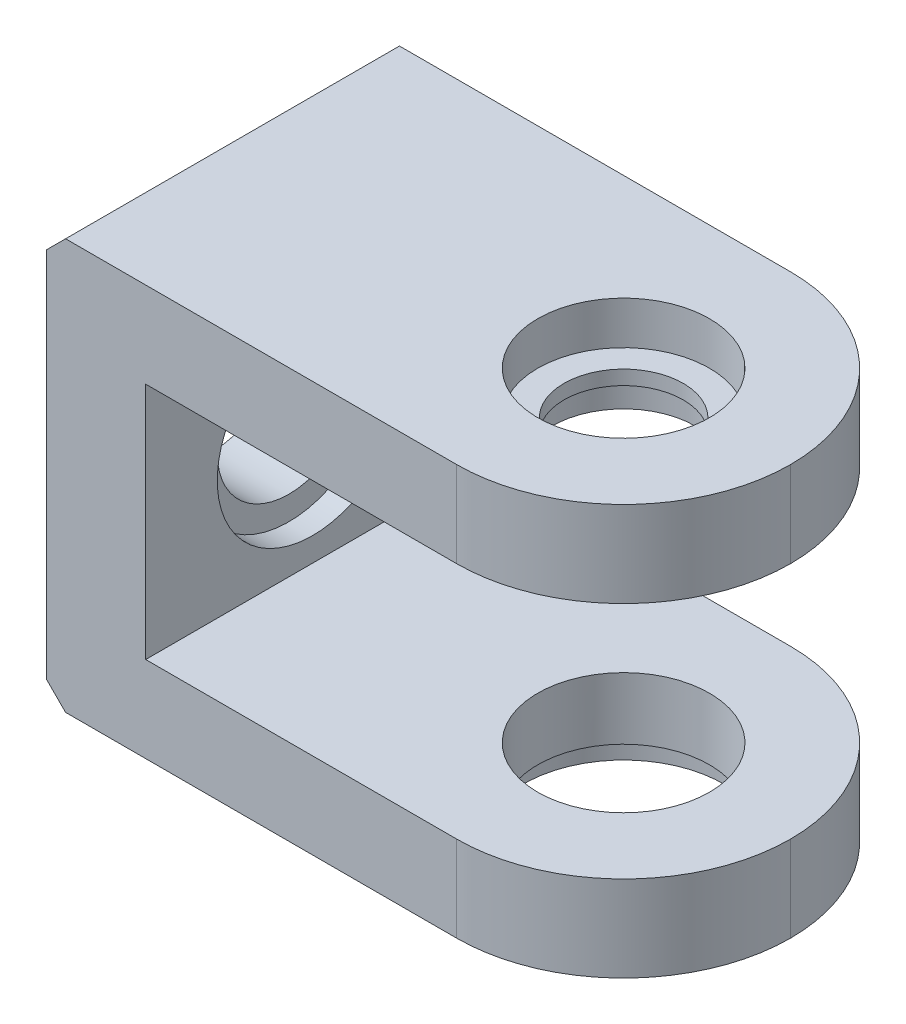
ISO-10303-21;
HEADER;
FILE_DESCRIPTION(('STEP AP214'),'2;1');
FILE_NAME('part.step','',(''),(''),'','','');
FILE_SCHEMA(('AUTOMOTIVE_DESIGN { 1 0 10303 214 1 1 1 1 }'));
ENDSEC;
DATA;
#1=APPLICATION_CONTEXT('core data for automotive mechanical design processes');
#2=APPLICATION_PROTOCOL_DEFINITION('international standard','automotive_design',2000,#1);
#3=PRODUCT_CONTEXT('',#1,'mechanical');
#4=PRODUCT('Part','Part','',(#3));
#5=PRODUCT_RELATED_PRODUCT_CATEGORY('part','',(#4));
#6=PRODUCT_DEFINITION_FORMATION('','',#4);
#7=PRODUCT_DEFINITION_CONTEXT('part definition',#1,'design');
#8=PRODUCT_DEFINITION('design','',#6,#7);
#9=PRODUCT_DEFINITION_SHAPE('','',#8);
#10=(LENGTH_UNIT() NAMED_UNIT(*) SI_UNIT(.MILLI.,.METRE.));
#11=(NAMED_UNIT(*) PLANE_ANGLE_UNIT() SI_UNIT($,.RADIAN.));
#12=(NAMED_UNIT(*) SI_UNIT($,.STERADIAN.) SOLID_ANGLE_UNIT());
#13=UNCERTAINTY_MEASURE_WITH_UNIT(LENGTH_MEASURE(1.E-05),#10,'distance_accuracy_value','');
#14=(GEOMETRIC_REPRESENTATION_CONTEXT(3) GLOBAL_UNCERTAINTY_ASSIGNED_CONTEXT((#13)) GLOBAL_UNIT_ASSIGNED_CONTEXT((#10,
#11,#12)) REPRESENTATION_CONTEXT('',''));
#15=CARTESIAN_POINT('',(0.,0.,0.));
#16=DIRECTION('',(0.,0.,1.));
#17=DIRECTION('',(1.,0.,0.));
#18=AXIS2_PLACEMENT_3D('',#15,#16,#17);
#19=CARTESIAN_POINT('',(-35.,0.001000000000001,35.));
#20=DIRECTION('',(0.,-1.,0.));
#21=DIRECTION('',(1.,0.,0.));
#22=AXIS2_PLACEMENT_3D('',#19,#20,#21);
#23=CYLINDRICAL_SURFACE('',#22,18.);
#24=CARTESIAN_POINT('',(-35.,-68.,35.));
#25=DIRECTION('',(0.,1.,0.));
#26=DIRECTION('',(0.,0.,1.));
#27=AXIS2_PLACEMENT_3D('',#24,#25,#26);
#28=CIRCLE('',#27,18.);
#29=CARTESIAN_POINT('',(-35.,-68.,53.));
#30=VERTEX_POINT('',#29);
#31=EDGE_CURVE('E206',#30,#30,#28,.F.);
#32=ORIENTED_EDGE('',*,*,#31,.F.);
#33=EDGE_LOOP('',(#32));
#34=FACE_BOUND('',#33,.T.);
#35=CARTESIAN_POINT('',(-35.,-81.,35.));
#36=DIRECTION('',(0.,-1.,0.));
#37=DIRECTION('',(1.,0.,0.));
#38=AXIS2_PLACEMENT_3D('',#35,#36,#37);
#39=CIRCLE('',#38,18.);
#40=CARTESIAN_POINT('',(-17.,-81.,35.));
#41=VERTEX_POINT('',#40);
#42=EDGE_CURVE('E203',#41,#41,#39,.F.);
#43=ORIENTED_EDGE('',*,*,#42,.F.);
#44=EDGE_LOOP('',(#43));
#45=FACE_BOUND('',#44,.T.);
#46=ADVANCED_FACE('F35',(#34,#45),#23,.F.);
#47=CARTESIAN_POINT('',(-35.,-86.001,35.));
#48=DIRECTION('',(0.,1.,0.));
#49=DIRECTION('',(-1.,0.,0.));
#50=AXIS2_PLACEMENT_3D('',#47,#48,#49);
#51=CYLINDRICAL_SURFACE('',#50,12.5);
#52=CARTESIAN_POINT('',(-35.,-9.00000000000001,35.));
#53=DIRECTION('',(0.,1.,0.));
#54=DIRECTION('',(-1.,0.,0.));
#55=AXIS2_PLACEMENT_3D('',#52,#53,#54);
#56=CIRCLE('',#55,12.5);
#57=CARTESIAN_POINT('',(-47.5,-9.00000000000001,35.));
#58=VERTEX_POINT('',#57);
#59=EDGE_CURVE('E193',#58,#58,#56,.F.);
#60=ORIENTED_EDGE('',*,*,#59,.F.);
#61=EDGE_LOOP('',(#60));
#62=FACE_BOUND('',#61,.T.);
#63=CARTESIAN_POINT('',(-35.,-12.,35.));
#64=DIRECTION('',(0.,-1.,0.));
#65=DIRECTION('',(0.,0.,-1.));
#66=AXIS2_PLACEMENT_3D('',#63,#64,#65);
#67=CIRCLE('',#66,12.5);
#68=CARTESIAN_POINT('',(-35.,-12.,22.5));
#69=VERTEX_POINT('',#68);
#70=EDGE_CURVE('E198',#69,#69,#67,.F.);
#71=ORIENTED_EDGE('',*,*,#70,.F.);
#72=EDGE_LOOP('',(#71));
#73=FACE_BOUND('',#72,.T.);
#74=ADVANCED_FACE('F317',(#62,#73),#51,.F.);
#75=CARTESIAN_POINT('',(0.001000000000001,-43.,35.));
#76=DIRECTION('',(-1.,0.,0.));
#77=DIRECTION('',(0.,0.,1.));
#78=AXIS2_PLACEMENT_3D('',#75,#76,#77);
#79=CYLINDRICAL_SURFACE('',#78,15.);
#80=CARTESIAN_POINT('',(-121.,-43.,35.));
#81=DIRECTION('',(-1.,0.,0.));
#82=DIRECTION('',(0.,0.,1.));
#83=AXIS2_PLACEMENT_3D('',#80,#81,#82);
#84=CIRCLE('',#83,15.);
#85=CARTESIAN_POINT('',(-121.,-43.,50.));
#86=VERTEX_POINT('',#85);
#87=EDGE_CURVE('E188',#86,#86,#84,.T.);
#88=ORIENTED_EDGE('',*,*,#87,.T.);
#89=EDGE_LOOP('',(#88));
#90=FACE_BOUND('',#89,.T.);
#91=CARTESIAN_POINT('',(-105.200761753188,-43.,35.));
#92=DIRECTION('',(1.,0.,0.));
#93=DIRECTION('',(0.,0.,-1.));
#94=AXIS2_PLACEMENT_3D('',#91,#92,#93);
#95=CIRCLE('',#94,15.);
#96=CARTESIAN_POINT('',(-105.200761753188,-43.,20.));
#97=VERTEX_POINT('',#96);
#98=EDGE_CURVE('E189',#97,#97,#95,.F.);
#99=ORIENTED_EDGE('',*,*,#98,.F.);
#100=EDGE_LOOP('',(#99));
#101=FACE_BOUND('',#100,.T.);
#102=ADVANCED_FACE('F323',(#90,#101),#79,.F.);
#103=CARTESIAN_POINT('',(-100.200761753188,-68.,70.));
#104=DIRECTION('',(-1.,0.,0.));
#105=DIRECTION('',(0.,0.,1.));
#106=AXIS2_PLACEMENT_3D('',#103,#104,#105);
#107=PLANE('',#106);
#108=CARTESIAN_POINT('',(-100.200761753188,-43.,35.));
#109=DIRECTION('',(1.,0.,0.));
#110=DIRECTION('',(0.,0.,-1.));
#111=AXIS2_PLACEMENT_3D('',#108,#109,#110);
#112=CIRCLE('',#111,20.);
#113=CARTESIAN_POINT('',(-100.200761753188,-43.,15.));
#114=VERTEX_POINT('',#113);
#115=EDGE_CURVE('E196',#114,#114,#112,.T.);
#116=ORIENTED_EDGE('',*,*,#115,.F.);
#117=EDGE_LOOP('',(#116));
#118=FACE_BOUND('',#117,.T.);
#119=DIRECTION('',(0.,1.,0.));
#120=VECTOR('',#119,1.);
#121=CARTESIAN_POINT('',(-100.200761753188,-68.,0.));
#122=LINE('',#121,#120);
#123=CARTESIAN_POINT('',(-100.200761753188,-68.,0.));
#124=VERTEX_POINT('',#123);
#125=CARTESIAN_POINT('',(-100.200761753188,-18.,0.));
#126=VERTEX_POINT('',#125);
#127=EDGE_CURVE('E152',#124,#126,#122,.T.);
#128=ORIENTED_EDGE('',*,*,#127,.T.);
#129=DIRECTION('',(0.,0.,-1.));
#130=VECTOR('',#129,1.);
#131=CARTESIAN_POINT('',(-100.200761753188,-18.,70.));
#132=LINE('',#131,#130);
#133=CARTESIAN_POINT('',(-100.200761753188,-18.,70.));
#134=VERTEX_POINT('',#133);
#135=EDGE_CURVE('E131',#134,#126,#132,.T.);
#136=ORIENTED_EDGE('',*,*,#135,.F.);
#137=DIRECTION('',(0.,1.,0.));
#138=VECTOR('',#137,1.);
#139=CARTESIAN_POINT('',(-100.200761753188,-68.,70.));
#140=LINE('',#139,#138);
#141=CARTESIAN_POINT('',(-100.200761753188,-68.,70.));
#142=VERTEX_POINT('',#141);
#143=EDGE_CURVE('E139',#142,#134,#140,.T.);
#144=ORIENTED_EDGE('',*,*,#143,.F.);
#145=DIRECTION('',(0.,0.,-1.));
#146=VECTOR('',#145,1.);
#147=CARTESIAN_POINT('',(-100.200761753188,-68.,70.));
#148=LINE('',#147,#146);
#149=EDGE_CURVE('E154',#142,#124,#148,.T.);
#150=ORIENTED_EDGE('',*,*,#149,.T.);
#151=EDGE_LOOP('',(#128,#136,#144,#150));
#152=FACE_BOUND('',#151,.T.);
#153=ADVANCED_FACE('F150',(#118,#152),#107,.F.);
#154=CARTESIAN_POINT('',(-100.200761753188,-18.,70.));
#155=DIRECTION('',(0.,1.,0.));
#156=DIRECTION('',(0.,0.,1.));
#157=AXIS2_PLACEMENT_3D('',#154,#155,#156);
#158=PLANE('',#157);
#159=CARTESIAN_POINT('',(-35.,-18.,35.));
#160=DIRECTION('',(0.,-1.,0.));
#161=DIRECTION('',(0.,0.,-1.));
#162=AXIS2_PLACEMENT_3D('',#159,#160,#161);
#163=CIRCLE('',#162,15.);
#164=CARTESIAN_POINT('',(-35.,-18.,20.));
#165=VERTEX_POINT('',#164);
#166=EDGE_CURVE('E284',#165,#165,#163,.T.);
#167=ORIENTED_EDGE('',*,*,#166,.F.);
#168=EDGE_LOOP('',(#167));
#169=FACE_BOUND('',#168,.T.);
#170=CARTESIAN_POINT('',(-35.,-18.,35.));
#171=DIRECTION('',(0.,1.,0.));
#172=DIRECTION('',(0.,0.,1.));
#173=AXIS2_PLACEMENT_3D('',#170,#171,#172);
#174=CIRCLE('',#173,35.);
#175=CARTESIAN_POINT('',(-35.,-18.,0.));
#176=VERTEX_POINT('',#175);
#177=CARTESIAN_POINT('',(0.,-18.,35.));
#178=VERTEX_POINT('',#177);
#179=EDGE_CURVE('E178',#176,#178,#174,.F.);
#180=ORIENTED_EDGE('',*,*,#179,.T.);
#181=CARTESIAN_POINT('',(-35.,-18.,35.));
#182=DIRECTION('',(0.,1.,0.));
#183=DIRECTION('',(0.,0.,1.));
#184=AXIS2_PLACEMENT_3D('',#181,#182,#183);
#185=CIRCLE('',#184,35.);
#186=CARTESIAN_POINT('',(-35.,-18.,70.));
#187=VERTEX_POINT('',#186);
#188=EDGE_CURVE('E134',#178,#187,#185,.F.);
#189=ORIENTED_EDGE('',*,*,#188,.T.);
#190=DIRECTION('',(1.,0.,0.));
#191=VECTOR('',#190,1.);
#192=CARTESIAN_POINT('',(-100.200761753188,-18.,70.));
#193=LINE('',#192,#191);
#194=EDGE_CURVE('E126',#134,#187,#193,.T.);
#195=ORIENTED_EDGE('',*,*,#194,.F.);
#196=ORIENTED_EDGE('',*,*,#135,.T.);
#197=DIRECTION('',(1.,0.,0.));
#198=VECTOR('',#197,1.);
#199=CARTESIAN_POINT('',(-100.200761753188,-18.,0.));
#200=LINE('',#199,#198);
#201=EDGE_CURVE('E244',#126,#176,#200,.T.);
#202=ORIENTED_EDGE('',*,*,#201,.T.);
#203=EDGE_LOOP('',(#180,#189,#195,#196,#202));
#204=FACE_BOUND('',#203,.T.);
#205=ADVANCED_FACE('F128',(#169,#204),#158,.F.);
#206=CARTESIAN_POINT('',(0.,0.,70.));
#207=DIRECTION('',(0.,-1.,0.));
#208=DIRECTION('',(1.,0.,0.));
#209=AXIS2_PLACEMENT_3D('',#206,#207,#208);
#210=PLANE('',#209);
#211=CARTESIAN_POINT('',(-35.,0.,35.));
#212=DIRECTION('',(0.,1.,0.));
#213=DIRECTION('',(-1.,0.,0.));
#214=AXIS2_PLACEMENT_3D('',#211,#212,#213);
#215=CIRCLE('',#214,18.);
#216=CARTESIAN_POINT('',(-53.,0.,35.));
#217=VERTEX_POINT('',#216);
#218=EDGE_CURVE('E201',#217,#217,#215,.T.);
#219=ORIENTED_EDGE('',*,*,#218,.F.);
#220=EDGE_LOOP('',(#219));
#221=FACE_BOUND('',#220,.T.);
#222=DIRECTION('',(-1.,0.,0.));
#223=VECTOR('',#222,1.);
#224=CARTESIAN_POINT('',(0.,0.,0.));
#225=LINE('',#224,#223);
#226=CARTESIAN_POINT('',(-35.,0.,0.));
#227=VERTEX_POINT('',#226);
#228=CARTESIAN_POINT('',(-117.,0.,0.));
#229=VERTEX_POINT('',#228);
#230=EDGE_CURVE('E241',#227,#229,#225,.T.);
#231=ORIENTED_EDGE('',*,*,#230,.T.);
#232=DIRECTION('',(0.,0.,1.));
#233=VECTOR('',#232,1.);
#234=CARTESIAN_POINT('',(-117.,0.,70.));
#235=LINE('',#234,#233);
#236=CARTESIAN_POINT('',(-117.,0.,70.));
#237=VERTEX_POINT('',#236);
#238=EDGE_CURVE('E11',#229,#237,#235,.T.);
#239=ORIENTED_EDGE('',*,*,#238,.T.);
#240=DIRECTION('',(-1.,0.,0.));
#241=VECTOR('',#240,1.);
#242=CARTESIAN_POINT('',(0.,0.,70.));
#243=LINE('',#242,#241);
#244=CARTESIAN_POINT('',(-35.,0.,70.));
#245=VERTEX_POINT('',#244);
#246=EDGE_CURVE('E138',#245,#237,#243,.T.);
#247=ORIENTED_EDGE('',*,*,#246,.F.);
#248=CARTESIAN_POINT('',(-35.,0.,35.));
#249=DIRECTION('',(0.,-1.,0.));
#250=DIRECTION('',(1.,0.,0.));
#251=AXIS2_PLACEMENT_3D('',#248,#249,#250);
#252=CIRCLE('',#251,35.);
#253=CARTESIAN_POINT('',(0.,0.,35.));
#254=VERTEX_POINT('',#253);
#255=EDGE_CURVE('E176',#245,#254,#252,.F.);
#256=ORIENTED_EDGE('',*,*,#255,.T.);
#257=CARTESIAN_POINT('',(-35.,0.,35.));
#258=DIRECTION('',(0.,-1.,0.));
#259=DIRECTION('',(1.,0.,0.));
#260=AXIS2_PLACEMENT_3D('',#257,#258,#259);
#261=CIRCLE('',#260,35.);
#262=EDGE_CURVE('E174',#254,#227,#261,.F.);
#263=ORIENTED_EDGE('',*,*,#262,.T.);
#264=EDGE_LOOP('',(#231,#239,#247,#256,#263));
#265=FACE_BOUND('',#264,.T.);
#266=ADVANCED_FACE('F271',(#221,#265),#210,.F.);
#267=CARTESIAN_POINT('',(-121.,0.,70.));
#268=DIRECTION('',(1.,0.,0.));
#269=DIRECTION('',(0.,0.,-1.));
#270=AXIS2_PLACEMENT_3D('',#267,#268,#269);
#271=PLANE('',#270);
#272=ORIENTED_EDGE('',*,*,#87,.F.);
#273=EDGE_LOOP('',(#272));
#274=FACE_BOUND('',#273,.T.);
#275=DIRECTION('',(0.,-1.,0.));
#276=VECTOR('',#275,1.);
#277=CARTESIAN_POINT('',(-121.,0.,0.));
#278=LINE('',#277,#276);
#279=CARTESIAN_POINT('',(-121.,-4.,0.));
#280=VERTEX_POINT('',#279);
#281=CARTESIAN_POINT('',(-121.,-81.9999999999999,0.));
#282=VERTEX_POINT('',#281);
#283=EDGE_CURVE('E237',#280,#282,#278,.T.);
#284=ORIENTED_EDGE('',*,*,#283,.T.);
#285=DIRECTION('',(0.,0.,1.));
#286=VECTOR('',#285,1.);
#287=CARTESIAN_POINT('',(-121.,-81.9999999999999,70.));
#288=LINE('',#287,#286);
#289=CARTESIAN_POINT('',(-121.,-81.9999999999999,70.));
#290=VERTEX_POINT('',#289);
#291=EDGE_CURVE('E56',#282,#290,#288,.T.);
#292=ORIENTED_EDGE('',*,*,#291,.T.);
#293=DIRECTION('',(0.,-1.,0.));
#294=VECTOR('',#293,1.);
#295=CARTESIAN_POINT('',(-121.,0.,70.));
#296=LINE('',#295,#294);
#297=CARTESIAN_POINT('',(-121.,-4.,70.));
#298=VERTEX_POINT('',#297);
#299=EDGE_CURVE('E224',#298,#290,#296,.T.);
#300=ORIENTED_EDGE('',*,*,#299,.F.);
#301=DIRECTION('',(0.,0.,-1.));
#302=VECTOR('',#301,1.);
#303=CARTESIAN_POINT('',(-121.,-4.,70.));
#304=LINE('',#303,#302);
#305=EDGE_CURVE('E214',#298,#280,#304,.T.);
#306=ORIENTED_EDGE('',*,*,#305,.T.);
#307=EDGE_LOOP('',(#284,#292,#300,#306));
#308=FACE_BOUND('',#307,.T.);
#309=ADVANCED_FACE('F239',(#274,#308),#271,.F.);
#310=CARTESIAN_POINT('',(0.,-86.,70.));
#311=DIRECTION('',(0.,-1.,0.));
#312=DIRECTION('',(1.,0.,0.));
#313=AXIS2_PLACEMENT_3D('',#310,#311,#312);
#314=PLANE('',#313);
#315=CARTESIAN_POINT('',(-35.,-86.,35.));
#316=DIRECTION('',(0.,-1.,0.));
#317=DIRECTION('',(1.,0.,0.));
#318=AXIS2_PLACEMENT_3D('',#315,#316,#317);
#319=CIRCLE('',#318,21.);
#320=CARTESIAN_POINT('',(-14.,-86.,35.));
#321=VERTEX_POINT('',#320);
#322=EDGE_CURVE('E291',#321,#321,#319,.T.);
#323=ORIENTED_EDGE('',*,*,#322,.F.);
#324=EDGE_LOOP('',(#323));
#325=FACE_BOUND('',#324,.T.);
#326=DIRECTION('',(-1.,0.,0.));
#327=VECTOR('',#326,1.);
#328=CARTESIAN_POINT('',(0.,-86.,70.));
#329=LINE('',#328,#327);
#330=CARTESIAN_POINT('',(-35.,-86.,70.));
#331=VERTEX_POINT('',#330);
#332=CARTESIAN_POINT('',(-117.,-86.,70.));
#333=VERTEX_POINT('',#332);
#334=EDGE_CURVE('E222',#331,#333,#329,.T.);
#335=ORIENTED_EDGE('',*,*,#334,.T.);
#336=DIRECTION('',(0.,0.,-1.));
#337=VECTOR('',#336,1.);
#338=CARTESIAN_POINT('',(-117.,-86.,0.));
#339=LINE('',#338,#337);
#340=CARTESIAN_POINT('',(-117.,-86.,0.));
#341=VERTEX_POINT('',#340);
#342=EDGE_CURVE('E181',#333,#341,#339,.T.);
#343=ORIENTED_EDGE('',*,*,#342,.T.);
#344=DIRECTION('',(-1.,0.,0.));
#345=VECTOR('',#344,1.);
#346=CARTESIAN_POINT('',(0.,-86.,0.));
#347=LINE('',#346,#345);
#348=CARTESIAN_POINT('',(-35.,-86.,0.));
#349=VERTEX_POINT('',#348);
#350=EDGE_CURVE('E238',#349,#341,#347,.T.);
#351=ORIENTED_EDGE('',*,*,#350,.F.);
#352=CARTESIAN_POINT('',(-35.,-86.,35.));
#353=DIRECTION('',(0.,-1.,0.));
#354=DIRECTION('',(1.,0.,0.));
#355=AXIS2_PLACEMENT_3D('',#352,#353,#354);
#356=CIRCLE('',#355,35.);
#357=CARTESIAN_POINT('',(0.,-86.,35.));
#358=VERTEX_POINT('',#357);
#359=EDGE_CURVE('E153',#349,#358,#356,.T.);
#360=ORIENTED_EDGE('',*,*,#359,.T.);
#361=CARTESIAN_POINT('',(-35.,-86.,35.));
#362=DIRECTION('',(0.,-1.,0.));
#363=DIRECTION('',(1.,0.,0.));
#364=AXIS2_PLACEMENT_3D('',#361,#362,#363);
#365=CIRCLE('',#364,35.);
#366=EDGE_CURVE('E156',#358,#331,#365,.T.);
#367=ORIENTED_EDGE('',*,*,#366,.T.);
#368=EDGE_LOOP('',(#335,#343,#351,#360,#367));
#369=FACE_BOUND('',#368,.T.);
#370=ADVANCED_FACE('F228',(#325,#369),#314,.T.);
#371=CARTESIAN_POINT('',(-100.200761753188,-68.,70.));
#372=DIRECTION('',(0.,1.,0.));
#373=DIRECTION('',(0.,0.,1.));
#374=AXIS2_PLACEMENT_3D('',#371,#372,#373);
#375=PLANE('',#374);
#376=ORIENTED_EDGE('',*,*,#31,.T.);
#377=EDGE_LOOP('',(#376));
#378=FACE_BOUND('',#377,.T.);
#379=DIRECTION('',(1.,0.,0.));
#380=VECTOR('',#379,1.);
#381=CARTESIAN_POINT('',(-100.200761753188,-68.,70.));
#382=LINE('',#381,#380);
#383=CARTESIAN_POINT('',(-35.,-68.,70.));
#384=VERTEX_POINT('',#383);
#385=EDGE_CURVE('E146',#142,#384,#382,.T.);
#386=ORIENTED_EDGE('',*,*,#385,.T.);
#387=CARTESIAN_POINT('',(-35.,-68.,35.));
#388=DIRECTION('',(0.,1.,0.));
#389=DIRECTION('',(0.,0.,1.));
#390=AXIS2_PLACEMENT_3D('',#387,#388,#389);
#391=CIRCLE('',#390,35.);
#392=CARTESIAN_POINT('',(0.,-68.,35.));
#393=VERTEX_POINT('',#392);
#394=EDGE_CURVE('E168',#384,#393,#391,.T.);
#395=ORIENTED_EDGE('',*,*,#394,.T.);
#396=CARTESIAN_POINT('',(-35.,-68.,35.));
#397=DIRECTION('',(0.,1.,0.));
#398=DIRECTION('',(0.,0.,1.));
#399=AXIS2_PLACEMENT_3D('',#396,#397,#398);
#400=CIRCLE('',#399,35.);
#401=CARTESIAN_POINT('',(-35.,-68.,0.));
#402=VERTEX_POINT('',#401);
#403=EDGE_CURVE('E166',#393,#402,#400,.T.);
#404=ORIENTED_EDGE('',*,*,#403,.T.);
#405=DIRECTION('',(1.,0.,0.));
#406=VECTOR('',#405,1.);
#407=CARTESIAN_POINT('',(-100.200761753188,-68.,0.));
#408=LINE('',#407,#406);
#409=EDGE_CURVE('E148',#124,#402,#408,.T.);
#410=ORIENTED_EDGE('',*,*,#409,.F.);
#411=ORIENTED_EDGE('',*,*,#149,.F.);
#412=EDGE_LOOP('',(#386,#395,#404,#410,#411));
#413=FACE_BOUND('',#412,.T.);
#414=ADVANCED_FACE('F258',(#378,#413),#375,.T.);
#415=CARTESIAN_POINT('',(0.,0.,70.));
#416=DIRECTION('',(0.,0.,-1.));
#417=DIRECTION('',(-1.,0.,0.));
#418=AXIS2_PLACEMENT_3D('',#415,#416,#417);
#419=PLANE('',#418);
#420=ORIENTED_EDGE('',*,*,#299,.T.);
#421=DIRECTION('',(0.707106781186546,-0.707106781186549,0.));
#422=VECTOR('',#421,1.);
#423=CARTESIAN_POINT('',(-117.,-86.,70.));
#424=LINE('',#423,#422);
#425=EDGE_CURVE('E43',#290,#333,#424,.T.);
#426=ORIENTED_EDGE('',*,*,#425,.T.);
#427=ORIENTED_EDGE('',*,*,#334,.F.);
#428=DIRECTION('',(0.,-1.,0.));
#429=VECTOR('',#428,1.);
#430=CARTESIAN_POINT('',(-35.,-68.,70.));
#431=LINE('',#430,#429);
#432=EDGE_CURVE('E164',#331,#384,#431,.F.);
#433=ORIENTED_EDGE('',*,*,#432,.T.);
#434=ORIENTED_EDGE('',*,*,#385,.F.);
#435=ORIENTED_EDGE('',*,*,#143,.T.);
#436=ORIENTED_EDGE('',*,*,#194,.T.);
#437=DIRECTION('',(0.,1.,0.));
#438=VECTOR('',#437,1.);
#439=CARTESIAN_POINT('',(-35.,0.,70.));
#440=LINE('',#439,#438);
#441=EDGE_CURVE('E162',#187,#245,#440,.T.);
#442=ORIENTED_EDGE('',*,*,#441,.T.);
#443=ORIENTED_EDGE('',*,*,#246,.T.);
#444=DIRECTION('',(0.70710678118655,0.707106781186545,0.));
#445=VECTOR('',#444,1.);
#446=CARTESIAN_POINT('',(-121.,-4.,70.));
#447=LINE('',#446,#445);
#448=EDGE_CURVE('E218',#237,#298,#447,.F.);
#449=ORIENTED_EDGE('',*,*,#448,.T.);
#450=EDGE_LOOP('',(#420,#426,#427,#433,#434,#435,#436,#442,#443,#449));
#451=FACE_BOUND('',#450,.T.);
#452=ADVANCED_FACE('F143',(#451),#419,.F.);
#453=CARTESIAN_POINT('',(0.,0.,0.));
#454=DIRECTION('',(0.,0.,-1.));
#455=DIRECTION('',(-1.,0.,0.));
#456=AXIS2_PLACEMENT_3D('',#453,#454,#455);
#457=PLANE('',#456);
#458=ORIENTED_EDGE('',*,*,#350,.T.);
#459=DIRECTION('',(-0.707106781186546,0.707106781186549,0.));
#460=VECTOR('',#459,1.);
#461=CARTESIAN_POINT('',(-101.5,-101.5,0.));
#462=LINE('',#461,#460);
#463=EDGE_CURVE('E212',#341,#282,#462,.T.);
#464=ORIENTED_EDGE('',*,*,#463,.T.);
#465=ORIENTED_EDGE('',*,*,#283,.F.);
#466=DIRECTION('',(-0.70710678118655,-0.707106781186545,0.));
#467=VECTOR('',#466,1.);
#468=CARTESIAN_POINT('',(-58.4999999999996,58.5,0.));
#469=LINE('',#468,#467);
#470=EDGE_CURVE('E210',#280,#229,#469,.F.);
#471=ORIENTED_EDGE('',*,*,#470,.T.);
#472=ORIENTED_EDGE('',*,*,#230,.F.);
#473=DIRECTION('',(0.,1.,0.));
#474=VECTOR('',#473,1.);
#475=CARTESIAN_POINT('',(-35.,-18.,0.));
#476=LINE('',#475,#474);
#477=EDGE_CURVE('E170',#227,#176,#476,.F.);
#478=ORIENTED_EDGE('',*,*,#477,.T.);
#479=ORIENTED_EDGE('',*,*,#201,.F.);
#480=ORIENTED_EDGE('',*,*,#127,.F.);
#481=ORIENTED_EDGE('',*,*,#409,.T.);
#482=DIRECTION('',(0.,-1.,0.));
#483=VECTOR('',#482,1.);
#484=CARTESIAN_POINT('',(-35.,0.,0.));
#485=LINE('',#484,#483);
#486=EDGE_CURVE('E172',#402,#349,#485,.T.);
#487=ORIENTED_EDGE('',*,*,#486,.T.);
#488=EDGE_LOOP('',(#458,#464,#465,#471,#472,#478,#479,#480,#481,#487));
#489=FACE_BOUND('',#488,.T.);
#490=ADVANCED_FACE('F236',(#489),#457,.T.);
#491=CARTESIAN_POINT('',(-35.,0.,35.));
#492=DIRECTION('',(0.,-1.,0.));
#493=DIRECTION('',(0.,0.,-1.));
#494=AXIS2_PLACEMENT_3D('',#491,#492,#493);
#495=CYLINDRICAL_SURFACE('',#494,35.);
#496=ORIENTED_EDGE('',*,*,#486,.F.);
#497=ORIENTED_EDGE('',*,*,#403,.F.);
#498=DIRECTION('',(0.,-1.,0.));
#499=VECTOR('',#498,1.);
#500=CARTESIAN_POINT('',(0.,-68.,35.));
#501=LINE('',#500,#499);
#502=EDGE_CURVE('E182',#358,#393,#501,.F.);
#503=ORIENTED_EDGE('',*,*,#502,.F.);
#504=ORIENTED_EDGE('',*,*,#359,.F.);
#505=EDGE_LOOP('',(#496,#497,#503,#504));
#506=FACE_BOUND('',#505,.T.);
#507=ADVANCED_FACE('F254',(#506),#495,.T.);
#508=CARTESIAN_POINT('',(-35.,-68.,35.));
#509=DIRECTION('',(0.,1.,0.));
#510=DIRECTION('',(0.,0.,1.));
#511=AXIS2_PLACEMENT_3D('',#508,#509,#510);
#512=CYLINDRICAL_SURFACE('',#511,35.);
#513=ORIENTED_EDGE('',*,*,#394,.F.);
#514=ORIENTED_EDGE('',*,*,#432,.F.);
#515=ORIENTED_EDGE('',*,*,#366,.F.);
#516=ORIENTED_EDGE('',*,*,#502,.T.);
#517=EDGE_LOOP('',(#513,#514,#515,#516));
#518=FACE_BOUND('',#517,.T.);
#519=ADVANCED_FACE('F257',(#518),#512,.T.);
#520=CARTESIAN_POINT('',(-35.,-18.,35.));
#521=DIRECTION('',(0.,-1.,0.));
#522=DIRECTION('',(0.,0.,-1.));
#523=AXIS2_PLACEMENT_3D('',#520,#521,#522);
#524=CYLINDRICAL_SURFACE('',#523,35.);
#525=DIRECTION('',(0.,1.,0.));
#526=VECTOR('',#525,1.);
#527=CARTESIAN_POINT('',(0.,0.,35.));
#528=LINE('',#527,#526);
#529=EDGE_CURVE('E185',#178,#254,#528,.T.);
#530=ORIENTED_EDGE('',*,*,#529,.F.);
#531=ORIENTED_EDGE('',*,*,#179,.F.);
#532=ORIENTED_EDGE('',*,*,#477,.F.);
#533=ORIENTED_EDGE('',*,*,#262,.F.);
#534=EDGE_LOOP('',(#530,#531,#532,#533));
#535=FACE_BOUND('',#534,.T.);
#536=ADVANCED_FACE('F266',(#535),#524,.T.);
#537=CARTESIAN_POINT('',(-35.,0.,35.));
#538=DIRECTION('',(0.,1.,0.));
#539=DIRECTION('',(0.,0.,1.));
#540=AXIS2_PLACEMENT_3D('',#537,#538,#539);
#541=CYLINDRICAL_SURFACE('',#540,35.);
#542=ORIENTED_EDGE('',*,*,#188,.F.);
#543=ORIENTED_EDGE('',*,*,#529,.T.);
#544=ORIENTED_EDGE('',*,*,#255,.F.);
#545=ORIENTED_EDGE('',*,*,#441,.F.);
#546=EDGE_LOOP('',(#542,#543,#544,#545));
#547=FACE_BOUND('',#546,.T.);
#548=ADVANCED_FACE('F269',(#547),#541,.T.);
#549=CARTESIAN_POINT('',(-105.200761753188,-43.,35.));
#550=DIRECTION('',(1.,0.,0.));
#551=DIRECTION('',(0.,0.,-1.));
#552=AXIS2_PLACEMENT_3D('',#549,#550,#551);
#553=PLANE('',#552);
#554=CARTESIAN_POINT('',(-105.200761753188,-43.,35.));
#555=DIRECTION('',(1.,0.,0.));
#556=DIRECTION('',(0.,0.,-1.));
#557=AXIS2_PLACEMENT_3D('',#554,#555,#556);
#558=CIRCLE('',#557,20.);
#559=CARTESIAN_POINT('',(-105.200761753188,-43.,15.));
#560=VERTEX_POINT('',#559);
#561=EDGE_CURVE('E192',#560,#560,#558,.T.);
#562=ORIENTED_EDGE('',*,*,#561,.T.);
#563=EDGE_LOOP('',(#562));
#564=FACE_BOUND('',#563,.T.);
#565=ORIENTED_EDGE('',*,*,#98,.T.);
#566=EDGE_LOOP('',(#565));
#567=FACE_BOUND('',#566,.T.);
#568=ADVANCED_FACE('F347',(#564,#567),#553,.T.);
#569=CARTESIAN_POINT('',(-105.200761753188,-43.,35.));
#570=DIRECTION('',(1.,0.,0.));
#571=DIRECTION('',(0.,0.,-1.));
#572=AXIS2_PLACEMENT_3D('',#569,#570,#571);
#573=CYLINDRICAL_SURFACE('',#572,20.);
#574=ORIENTED_EDGE('',*,*,#561,.F.);
#575=EDGE_LOOP('',(#574));
#576=FACE_BOUND('',#575,.T.);
#577=ORIENTED_EDGE('',*,*,#115,.T.);
#578=EDGE_LOOP('',(#577));
#579=FACE_BOUND('',#578,.T.);
#580=ADVANCED_FACE('F342',(#576,#579),#573,.F.);
#581=CARTESIAN_POINT('',(-35.,-9.,35.));
#582=DIRECTION('',(0.,1.,0.));
#583=DIRECTION('',(-1.,0.,0.));
#584=AXIS2_PLACEMENT_3D('',#581,#582,#583);
#585=PLANE('',#584);
#586=CARTESIAN_POINT('',(-35.,-9.,35.));
#587=DIRECTION('',(0.,1.,0.));
#588=DIRECTION('',(-1.,0.,0.));
#589=AXIS2_PLACEMENT_3D('',#586,#587,#588);
#590=CIRCLE('',#589,18.);
#591=CARTESIAN_POINT('',(-53.,-9.00000000000001,35.));
#592=VERTEX_POINT('',#591);
#593=EDGE_CURVE('E197',#592,#592,#590,.T.);
#594=ORIENTED_EDGE('',*,*,#593,.T.);
#595=EDGE_LOOP('',(#594));
#596=FACE_BOUND('',#595,.T.);
#597=ORIENTED_EDGE('',*,*,#59,.T.);
#598=EDGE_LOOP('',(#597));
#599=FACE_BOUND('',#598,.T.);
#600=ADVANCED_FACE('F339',(#596,#599),#585,.T.);
#601=CARTESIAN_POINT('',(-35.,-9.,35.));
#602=DIRECTION('',(0.,1.,0.));
#603=DIRECTION('',(-1.,0.,0.));
#604=AXIS2_PLACEMENT_3D('',#601,#602,#603);
#605=CYLINDRICAL_SURFACE('',#604,18.);
#606=ORIENTED_EDGE('',*,*,#593,.F.);
#607=EDGE_LOOP('',(#606));
#608=FACE_BOUND('',#607,.T.);
#609=ORIENTED_EDGE('',*,*,#218,.T.);
#610=EDGE_LOOP('',(#609));
#611=FACE_BOUND('',#610,.T.);
#612=ADVANCED_FACE('F334',(#608,#611),#605,.F.);
#613=CARTESIAN_POINT('',(-35.,-12.,35.));
#614=DIRECTION('',(0.,-1.,0.));
#615=DIRECTION('',(0.,0.,-1.));
#616=AXIS2_PLACEMENT_3D('',#613,#614,#615);
#617=PLANE('',#616);
#618=CARTESIAN_POINT('',(-35.,-12.,35.));
#619=DIRECTION('',(0.,-1.,0.));
#620=DIRECTION('',(0.,0.,-1.));
#621=AXIS2_PLACEMENT_3D('',#618,#619,#620);
#622=CIRCLE('',#621,15.);
#623=CARTESIAN_POINT('',(-35.,-12.,20.));
#624=VERTEX_POINT('',#623);
#625=EDGE_CURVE('E202',#624,#624,#622,.T.);
#626=ORIENTED_EDGE('',*,*,#625,.T.);
#627=EDGE_LOOP('',(#626));
#628=FACE_BOUND('',#627,.T.);
#629=ORIENTED_EDGE('',*,*,#70,.T.);
#630=EDGE_LOOP('',(#629));
#631=FACE_BOUND('',#630,.T.);
#632=ADVANCED_FACE('F330',(#628,#631),#617,.T.);
#633=CARTESIAN_POINT('',(-35.,-12.,35.));
#634=DIRECTION('',(0.,-1.,0.));
#635=DIRECTION('',(0.,0.,-1.));
#636=AXIS2_PLACEMENT_3D('',#633,#634,#635);
#637=CYLINDRICAL_SURFACE('',#636,15.);
#638=ORIENTED_EDGE('',*,*,#625,.F.);
#639=EDGE_LOOP('',(#638));
#640=FACE_BOUND('',#639,.T.);
#641=ORIENTED_EDGE('',*,*,#166,.T.);
#642=EDGE_LOOP('',(#641));
#643=FACE_BOUND('',#642,.T.);
#644=ADVANCED_FACE('F333',(#640,#643),#637,.F.);
#645=CARTESIAN_POINT('',(-35.,-81.,35.));
#646=DIRECTION('',(0.,-1.,0.));
#647=DIRECTION('',(1.,0.,0.));
#648=AXIS2_PLACEMENT_3D('',#645,#646,#647);
#649=PLANE('',#648);
#650=CARTESIAN_POINT('',(-35.,-81.,35.));
#651=DIRECTION('',(0.,-1.,0.));
#652=DIRECTION('',(1.,0.,0.));
#653=AXIS2_PLACEMENT_3D('',#650,#651,#652);
#654=CIRCLE('',#653,21.);
#655=CARTESIAN_POINT('',(-14.,-81.,35.));
#656=VERTEX_POINT('',#655);
#657=EDGE_CURVE('E207',#656,#656,#654,.T.);
#658=ORIENTED_EDGE('',*,*,#657,.T.);
#659=EDGE_LOOP('',(#658));
#660=FACE_BOUND('',#659,.T.);
#661=ORIENTED_EDGE('',*,*,#42,.T.);
#662=EDGE_LOOP('',(#661));
#663=FACE_BOUND('',#662,.T.);
#664=ADVANCED_FACE('F297',(#660,#663),#649,.T.);
#665=CARTESIAN_POINT('',(-35.,-81.,35.));
#666=DIRECTION('',(0.,-1.,0.));
#667=DIRECTION('',(1.,0.,0.));
#668=AXIS2_PLACEMENT_3D('',#665,#666,#667);
#669=CYLINDRICAL_SURFACE('',#668,21.);
#670=ORIENTED_EDGE('',*,*,#657,.F.);
#671=EDGE_LOOP('',(#670));
#672=FACE_BOUND('',#671,.T.);
#673=ORIENTED_EDGE('',*,*,#322,.T.);
#674=EDGE_LOOP('',(#673));
#675=FACE_BOUND('',#674,.T.);
#676=ADVANCED_FACE('F300',(#672,#675),#669,.F.);
#677=CARTESIAN_POINT('',(-117.,-86.,70.));
#678=DIRECTION('',(-0.707106781186549,-0.707106781186546,0.));
#679=DIRECTION('',(0.,0.,1.));
#680=AXIS2_PLACEMENT_3D('',#677,#678,#679);
#681=PLANE('',#680);
#682=ORIENTED_EDGE('',*,*,#425,.F.);
#683=ORIENTED_EDGE('',*,*,#291,.F.);
#684=ORIENTED_EDGE('',*,*,#463,.F.);
#685=ORIENTED_EDGE('',*,*,#342,.F.);
#686=EDGE_LOOP('',(#682,#683,#684,#685));
#687=FACE_BOUND('',#686,.T.);
#688=ADVANCED_FACE('F233',(#687),#681,.T.);
#689=CARTESIAN_POINT('',(-121.,-4.,70.));
#690=DIRECTION('',(0.707106781186545,-0.70710678118655,0.));
#691=DIRECTION('',(0.,0.,-1.));
#692=AXIS2_PLACEMENT_3D('',#689,#690,#691);
#693=PLANE('',#692);
#694=ORIENTED_EDGE('',*,*,#448,.F.);
#695=ORIENTED_EDGE('',*,*,#238,.F.);
#696=ORIENTED_EDGE('',*,*,#470,.F.);
#697=ORIENTED_EDGE('',*,*,#305,.F.);
#698=EDGE_LOOP('',(#694,#695,#696,#697));
#699=FACE_BOUND('',#698,.T.);
#700=ADVANCED_FACE('F37',(#699),#693,.F.);
#701=CLOSED_SHELL('',(#46,#74,#102,#153,#205,#266,#309,#370,#414,#452,#490,#507,#519,#536,#548,
#568,#580,#600,#612,#632,#644,#664,#676,#688,#700));
#702=MANIFOLD_SOLID_BREP('B2',#701);
#703=ADVANCED_BREP_SHAPE_REPRESENTATION('',(#18,#702),#14);
#704=SHAPE_DEFINITION_REPRESENTATION(#9,#703);
ENDSEC;
END-ISO-10303-21;
